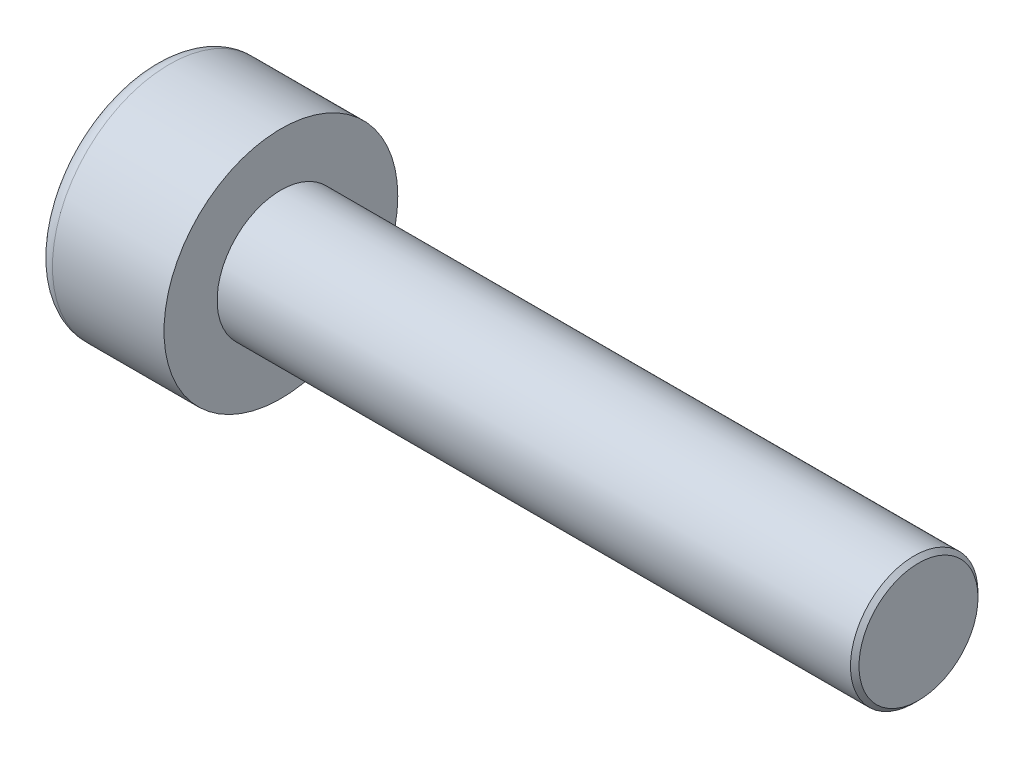
ISO-10303-21;
HEADER;
FILE_DESCRIPTION(('STEP AP214'),'2;1');
FILE_NAME('part.step','',(''),(''),'','','');
FILE_SCHEMA(('AUTOMOTIVE_DESIGN { 1 0 10303 214 1 1 1 1 }'));
ENDSEC;
DATA;
#1=APPLICATION_CONTEXT('core data for automotive mechanical design processes');
#2=APPLICATION_PROTOCOL_DEFINITION('international standard','automotive_design',2000,#1);
#3=PRODUCT_CONTEXT('',#1,'mechanical');
#4=PRODUCT('Part','Part','',(#3));
#5=PRODUCT_RELATED_PRODUCT_CATEGORY('part','',(#4));
#6=PRODUCT_DEFINITION_FORMATION('','',#4);
#7=PRODUCT_DEFINITION_CONTEXT('part definition',#1,'design');
#8=PRODUCT_DEFINITION('design','',#6,#7);
#9=PRODUCT_DEFINITION_SHAPE('','',#8);
#10=(LENGTH_UNIT() NAMED_UNIT(*) SI_UNIT(.MILLI.,.METRE.));
#11=(NAMED_UNIT(*) PLANE_ANGLE_UNIT() SI_UNIT($,.RADIAN.));
#12=(NAMED_UNIT(*) SI_UNIT($,.STERADIAN.) SOLID_ANGLE_UNIT());
#13=UNCERTAINTY_MEASURE_WITH_UNIT(LENGTH_MEASURE(1.E-05),#10,'distance_accuracy_value','');
#14=(GEOMETRIC_REPRESENTATION_CONTEXT(3) GLOBAL_UNCERTAINTY_ASSIGNED_CONTEXT((#13)) GLOBAL_UNIT_ASSIGNED_CONTEXT((#10,
#11,#12)) REPRESENTATION_CONTEXT('',''));
#15=CARTESIAN_POINT('',(0.,0.,0.));
#16=DIRECTION('',(0.,0.,1.));
#17=DIRECTION('',(1.,0.,0.));
#18=AXIS2_PLACEMENT_3D('',#15,#16,#17);
#19=CARTESIAN_POINT('',(1.3,-2.5,0.));
#20=DIRECTION('',(-1.,0.,0.));
#21=DIRECTION('',(0.,0.,1.));
#22=AXIS2_PLACEMENT_3D('',#19,#20,#21);
#23=PLANE('',#22);
#24=DIRECTION('',(0.,-0.866025403784438,-0.5));
#25=VECTOR('',#24,1.);
#26=CARTESIAN_POINT('',(1.3,0.,1.44337567297406));
#27=LINE('',#26,#25);
#28=CARTESIAN_POINT('',(1.3,-0.625,1.08253175473055));
#29=VERTEX_POINT('',#28);
#30=CARTESIAN_POINT('',(1.3,-1.25,0.721687836487031));
#31=VERTEX_POINT('',#30);
#32=EDGE_CURVE('E165',#29,#31,#27,.T.);
#33=ORIENTED_EDGE('',*,*,#32,.F.);
#34=CARTESIAN_POINT('',(1.3,0.,0.));
#35=DIRECTION('',(-1.,0.,0.));
#36=DIRECTION('',(0.,0.,1.));
#37=AXIS2_PLACEMENT_3D('',#34,#35,#36);
#38=CIRCLE('',#37,1.25);
#39=CARTESIAN_POINT('',(1.3,-1.25,0.));
#40=VERTEX_POINT('',#39);
#41=EDGE_CURVE('E60',#29,#40,#38,.F.);
#42=ORIENTED_EDGE('',*,*,#41,.T.);
#43=DIRECTION('',(0.,0.,-1.));
#44=VECTOR('',#43,1.);
#45=CARTESIAN_POINT('',(1.3,-1.25,0.721687836487031));
#46=LINE('',#45,#44);
#47=EDGE_CURVE('E170',#31,#40,#46,.T.);
#48=ORIENTED_EDGE('',*,*,#47,.F.);
#49=EDGE_LOOP('',(#33,#42,#48));
#50=FACE_BOUND('',#49,.T.);
#51=ADVANCED_FACE('F45',(#50),#23,.T.);
#52=CARTESIAN_POINT('',(1.3,-1.25,-0.721687836487036));
#53=VERTEX_POINT('',#52);
#54=EDGE_CURVE('E169',#40,#53,#46,.T.);
#55=ORIENTED_EDGE('',*,*,#54,.F.);
#56=CARTESIAN_POINT('',(1.3,-0.625,-1.08253175473055));
#57=VERTEX_POINT('',#56);
#58=EDGE_CURVE('E145',#40,#57,#38,.F.);
#59=ORIENTED_EDGE('',*,*,#58,.T.);
#60=DIRECTION('',(0.,0.866025403784439,-0.5));
#61=VECTOR('',#60,1.);
#62=CARTESIAN_POINT('',(1.3,-1.25,-0.721687836487036));
#63=LINE('',#62,#61);
#64=EDGE_CURVE('E153',#53,#57,#63,.T.);
#65=ORIENTED_EDGE('',*,*,#64,.F.);
#66=EDGE_LOOP('',(#55,#59,#65));
#67=FACE_BOUND('',#66,.T.);
#68=ADVANCED_FACE('F226',(#67),#23,.T.);
#69=CARTESIAN_POINT('',(1.3,0.,-1.44337567297407));
#70=VERTEX_POINT('',#69);
#71=EDGE_CURVE('E143',#57,#70,#63,.T.);
#72=ORIENTED_EDGE('',*,*,#71,.F.);
#73=CARTESIAN_POINT('',(1.3,0.624999999999999,-1.08253175473055));
#74=VERTEX_POINT('',#73);
#75=EDGE_CURVE('E127',#57,#74,#38,.F.);
#76=ORIENTED_EDGE('',*,*,#75,.T.);
#77=DIRECTION('',(0.,0.866025403784439,0.5));
#78=VECTOR('',#77,1.);
#79=CARTESIAN_POINT('',(1.3,0.,-1.44337567297407));
#80=LINE('',#79,#78);
#81=EDGE_CURVE('E141',#70,#74,#80,.T.);
#82=ORIENTED_EDGE('',*,*,#81,.F.);
#83=EDGE_LOOP('',(#72,#76,#82));
#84=FACE_BOUND('',#83,.T.);
#85=ADVANCED_FACE('F139',(#84),#23,.T.);
#86=CARTESIAN_POINT('',(1.3,1.25,-0.721687836487031));
#87=VERTEX_POINT('',#86);
#88=EDGE_CURVE('E147',#74,#87,#80,.T.);
#89=ORIENTED_EDGE('',*,*,#88,.F.);
#90=CARTESIAN_POINT('',(1.3,0.,0.));
#91=DIRECTION('',(1.,0.,0.));
#92=DIRECTION('',(0.,0.,-1.));
#93=AXIS2_PLACEMENT_3D('',#90,#91,#92);
#94=CIRCLE('',#93,1.25);
#95=CARTESIAN_POINT('',(1.3,1.25,0.));
#96=VERTEX_POINT('',#95);
#97=EDGE_CURVE('E125',#74,#96,#94,.T.);
#98=ORIENTED_EDGE('',*,*,#97,.T.);
#99=DIRECTION('',(0.,0.,1.));
#100=VECTOR('',#99,1.);
#101=CARTESIAN_POINT('',(1.3,1.25,-0.721687836487031));
#102=LINE('',#101,#100);
#103=EDGE_CURVE('E150',#87,#96,#102,.T.);
#104=ORIENTED_EDGE('',*,*,#103,.F.);
#105=EDGE_LOOP('',(#89,#98,#104));
#106=FACE_BOUND('',#105,.T.);
#107=ADVANCED_FACE('F148',(#106),#23,.T.);
#108=CARTESIAN_POINT('',(1.3,1.25,0.721687836487031));
#109=VERTEX_POINT('',#108);
#110=EDGE_CURVE('E157',#96,#109,#102,.T.);
#111=ORIENTED_EDGE('',*,*,#110,.F.);
#112=CARTESIAN_POINT('',(1.3,0.625,1.08253175473055));
#113=VERTEX_POINT('',#112);
#114=EDGE_CURVE('E130',#96,#113,#38,.F.);
#115=ORIENTED_EDGE('',*,*,#114,.T.);
#116=DIRECTION('',(0.,-0.866025403784438,0.5));
#117=VECTOR('',#116,1.);
#118=CARTESIAN_POINT('',(1.3,1.25,0.721687836487031));
#119=LINE('',#118,#117);
#120=EDGE_CURVE('E162',#109,#113,#119,.T.);
#121=ORIENTED_EDGE('',*,*,#120,.F.);
#122=EDGE_LOOP('',(#111,#115,#121));
#123=FACE_BOUND('',#122,.T.);
#124=ADVANCED_FACE('F238',(#123),#23,.T.);
#125=CARTESIAN_POINT('',(1.3,0.,1.44337567297406));
#126=VERTEX_POINT('',#125);
#127=EDGE_CURVE('E161',#113,#126,#119,.T.);
#128=ORIENTED_EDGE('',*,*,#127,.F.);
#129=EDGE_CURVE('E206',#113,#29,#38,.F.);
#130=ORIENTED_EDGE('',*,*,#129,.T.);
#131=EDGE_CURVE('E166',#126,#29,#27,.T.);
#132=ORIENTED_EDGE('',*,*,#131,.F.);
#133=EDGE_LOOP('',(#128,#130,#132));
#134=FACE_BOUND('',#133,.T.);
#135=ADVANCED_FACE('F229',(#134),#23,.T.);
#136=CARTESIAN_POINT('',(0.,0.,0.));
#137=DIRECTION('',(1.,0.,0.));
#138=DIRECTION('',(0.,0.,-1.));
#139=AXIS2_PLACEMENT_3D('',#136,#137,#138);
#140=PLANE('',#139);
#141=CARTESIAN_POINT('',(0.,0.,0.));
#142=DIRECTION('',(1.,0.,0.));
#143=DIRECTION('',(0.,0.,-1.));
#144=AXIS2_PLACEMENT_3D('',#141,#142,#143);
#145=CIRCLE('',#144,2.375);
#146=CARTESIAN_POINT('',(0.,0.,-2.375));
#147=VERTEX_POINT('',#146);
#148=EDGE_CURVE('E211',#147,#147,#145,.F.);
#149=ORIENTED_EDGE('',*,*,#148,.T.);
#150=EDGE_LOOP('',(#149));
#151=FACE_BOUND('',#150,.T.);
#152=DIRECTION('',(0.,0.866025403784439,-0.5));
#153=VECTOR('',#152,1.);
#154=CARTESIAN_POINT('',(0.,-1.25,-0.721687836487036));
#155=LINE('',#154,#153);
#156=CARTESIAN_POINT('',(0.,-1.25,-0.721687836487036));
#157=VERTEX_POINT('',#156);
#158=CARTESIAN_POINT('',(0.,0.,-1.44337567297407));
#159=VERTEX_POINT('',#158);
#160=EDGE_CURVE('E68',#157,#159,#155,.T.);
#161=ORIENTED_EDGE('',*,*,#160,.T.);
#162=DIRECTION('',(0.,0.866025403784439,0.5));
#163=VECTOR('',#162,1.);
#164=CARTESIAN_POINT('',(0.,0.,-1.44337567297407));
#165=LINE('',#164,#163);
#166=CARTESIAN_POINT('',(0.,1.25,-0.721687836487031));
#167=VERTEX_POINT('',#166);
#168=EDGE_CURVE('E175',#159,#167,#165,.T.);
#169=ORIENTED_EDGE('',*,*,#168,.T.);
#170=DIRECTION('',(0.,0.,1.));
#171=VECTOR('',#170,1.);
#172=CARTESIAN_POINT('',(0.,1.25,-0.721687836487031));
#173=LINE('',#172,#171);
#174=CARTESIAN_POINT('',(0.,1.25,0.721687836487031));
#175=VERTEX_POINT('',#174);
#176=EDGE_CURVE('E178',#167,#175,#173,.T.);
#177=ORIENTED_EDGE('',*,*,#176,.T.);
#178=DIRECTION('',(0.,-0.866025403784438,0.5));
#179=VECTOR('',#178,1.);
#180=CARTESIAN_POINT('',(0.,1.25,0.721687836487031));
#181=LINE('',#180,#179);
#182=CARTESIAN_POINT('',(0.,0.,1.44337567297406));
#183=VERTEX_POINT('',#182);
#184=EDGE_CURVE('E181',#175,#183,#181,.T.);
#185=ORIENTED_EDGE('',*,*,#184,.T.);
#186=DIRECTION('',(0.,-0.866025403784438,-0.5));
#187=VECTOR('',#186,1.);
#188=CARTESIAN_POINT('',(0.,0.,1.44337567297406));
#189=LINE('',#188,#187);
#190=CARTESIAN_POINT('',(0.,-1.25,0.721687836487031));
#191=VERTEX_POINT('',#190);
#192=EDGE_CURVE('E184',#183,#191,#189,.T.);
#193=ORIENTED_EDGE('',*,*,#192,.T.);
#194=DIRECTION('',(0.,0.,-1.));
#195=VECTOR('',#194,1.);
#196=CARTESIAN_POINT('',(0.,-1.25,0.721687836487031));
#197=LINE('',#196,#195);
#198=EDGE_CURVE('E187',#191,#157,#197,.T.);
#199=ORIENTED_EDGE('',*,*,#198,.T.);
#200=EDGE_LOOP('',(#161,#169,#177,#185,#193,#199));
#201=FACE_BOUND('',#200,.T.);
#202=ADVANCED_FACE('F237',(#151,#201),#140,.F.);
#203=CARTESIAN_POINT('',(3.,0.,0.));
#204=DIRECTION('',(1.,0.,0.));
#205=DIRECTION('',(0.,0.,-1.));
#206=AXIS2_PLACEMENT_3D('',#203,#204,#205);
#207=PLANE('',#206);
#208=CARTESIAN_POINT('',(3.,0.,0.));
#209=DIRECTION('',(1.,0.,0.));
#210=DIRECTION('',(0.,0.,-1.));
#211=AXIS2_PLACEMENT_3D('',#208,#209,#210);
#212=CIRCLE('',#211,2.75);
#213=CARTESIAN_POINT('',(3.,0.,-2.75));
#214=VERTEX_POINT('',#213);
#215=EDGE_CURVE('E203',#214,#214,#212,.T.);
#216=ORIENTED_EDGE('',*,*,#215,.T.);
#217=EDGE_LOOP('',(#216));
#218=FACE_BOUND('',#217,.T.);
#219=CARTESIAN_POINT('',(3.,0.,0.));
#220=DIRECTION('',(1.,0.,0.));
#221=DIRECTION('',(0.,0.,-1.));
#222=AXIS2_PLACEMENT_3D('',#219,#220,#221);
#223=CIRCLE('',#222,1.5);
#224=CARTESIAN_POINT('',(3.,0.,-1.5));
#225=VERTEX_POINT('',#224);
#226=EDGE_CURVE('E200',#225,#225,#223,.T.);
#227=ORIENTED_EDGE('',*,*,#226,.F.);
#228=EDGE_LOOP('',(#227));
#229=FACE_BOUND('',#228,.T.);
#230=ADVANCED_FACE('F244',(#218,#229),#207,.T.);
#231=CARTESIAN_POINT('',(3.,0.,0.));
#232=DIRECTION('',(-1.,0.,0.));
#233=DIRECTION('',(0.,0.,1.));
#234=AXIS2_PLACEMENT_3D('',#231,#232,#233);
#235=CYLINDRICAL_SURFACE('',#234,2.75);
#236=CARTESIAN_POINT('',(0.375,0.,0.));
#237=DIRECTION('',(1.,0.,0.));
#238=DIRECTION('',(0.,0.,-1.));
#239=AXIS2_PLACEMENT_3D('',#236,#237,#238);
#240=CIRCLE('',#239,2.75);
#241=CARTESIAN_POINT('',(0.375,0.,-2.75));
#242=VERTEX_POINT('',#241);
#243=EDGE_CURVE('E208',#242,#242,#240,.T.);
#244=ORIENTED_EDGE('',*,*,#243,.T.);
#245=EDGE_LOOP('',(#244));
#246=FACE_BOUND('',#245,.T.);
#247=ORIENTED_EDGE('',*,*,#215,.F.);
#248=EDGE_LOOP('',(#247));
#249=FACE_BOUND('',#248,.T.);
#250=ADVANCED_FACE('F289',(#246,#249),#235,.T.);
#251=CARTESIAN_POINT('',(18.,0.,0.));
#252=DIRECTION('',(-1.,0.,0.));
#253=DIRECTION('',(0.,0.,1.));
#254=AXIS2_PLACEMENT_3D('',#251,#252,#253);
#255=CYLINDRICAL_SURFACE('',#254,1.5);
#256=CARTESIAN_POINT('',(17.9,0.,0.));
#257=DIRECTION('',(1.,0.,0.));
#258=DIRECTION('',(0.,0.,-1.));
#259=AXIS2_PLACEMENT_3D('',#256,#257,#258);
#260=CIRCLE('',#259,1.5);
#261=CARTESIAN_POINT('',(17.9,0.,-1.5));
#262=VERTEX_POINT('',#261);
#263=EDGE_CURVE('E11',#262,#262,#260,.F.);
#264=ORIENTED_EDGE('',*,*,#263,.T.);
#265=EDGE_LOOP('',(#264));
#266=FACE_BOUND('',#265,.T.);
#267=ORIENTED_EDGE('',*,*,#226,.T.);
#268=EDGE_LOOP('',(#267));
#269=FACE_BOUND('',#268,.T.);
#270=ADVANCED_FACE('F286',(#266,#269),#255,.T.);
#271=CARTESIAN_POINT('',(18.,0.,0.));
#272=DIRECTION('',(1.,0.,0.));
#273=DIRECTION('',(0.,0.,-1.));
#274=AXIS2_PLACEMENT_3D('',#271,#272,#273);
#275=PLANE('',#274);
#276=CARTESIAN_POINT('',(18.,0.,0.));
#277=DIRECTION('',(1.,0.,0.));
#278=DIRECTION('',(0.,0.,-1.));
#279=AXIS2_PLACEMENT_3D('',#276,#277,#278);
#280=CIRCLE('',#279,1.4);
#281=CARTESIAN_POINT('',(18.,0.,-1.4));
#282=VERTEX_POINT('',#281);
#283=EDGE_CURVE('E53',#282,#282,#280,.T.);
#284=ORIENTED_EDGE('',*,*,#283,.T.);
#285=EDGE_LOOP('',(#284));
#286=FACE_BOUND('',#285,.T.);
#287=ADVANCED_FACE('F216',(#286),#275,.T.);
#288=CARTESIAN_POINT('',(1.3,-1.25,-0.721687836487036));
#289=DIRECTION('',(0.,0.5,0.866025403784439));
#290=DIRECTION('',(0.,-0.866025403784439,0.5));
#291=AXIS2_PLACEMENT_3D('',#288,#289,#290);
#292=PLANE('',#291);
#293=ORIENTED_EDGE('',*,*,#160,.F.);
#294=DIRECTION('',(-1.,0.,0.));
#295=VECTOR('',#294,1.);
#296=CARTESIAN_POINT('',(1.3,-1.25,-0.721687836487036));
#297=LINE('',#296,#295);
#298=EDGE_CURVE('E173',#53,#157,#297,.T.);
#299=ORIENTED_EDGE('',*,*,#298,.F.);
#300=ORIENTED_EDGE('',*,*,#64,.T.);
#301=ORIENTED_EDGE('',*,*,#71,.T.);
#302=DIRECTION('',(-1.,0.,0.));
#303=VECTOR('',#302,1.);
#304=CARTESIAN_POINT('',(1.3,0.,-1.44337567297407));
#305=LINE('',#304,#303);
#306=EDGE_CURVE('E156',#70,#159,#305,.T.);
#307=ORIENTED_EDGE('',*,*,#306,.T.);
#308=EDGE_LOOP('',(#293,#299,#300,#301,#307));
#309=FACE_BOUND('',#308,.T.);
#310=ADVANCED_FACE('F260',(#309),#292,.T.);
#311=CARTESIAN_POINT('',(1.3,0.,-1.44337567297407));
#312=DIRECTION('',(0.,-0.5,0.866025403784439));
#313=DIRECTION('',(0.,-0.866025403784439,-0.5));
#314=AXIS2_PLACEMENT_3D('',#311,#312,#313);
#315=PLANE('',#314);
#316=ORIENTED_EDGE('',*,*,#168,.F.);
#317=ORIENTED_EDGE('',*,*,#306,.F.);
#318=ORIENTED_EDGE('',*,*,#81,.T.);
#319=ORIENTED_EDGE('',*,*,#88,.T.);
#320=DIRECTION('',(-1.,0.,0.));
#321=VECTOR('',#320,1.);
#322=CARTESIAN_POINT('',(1.3,1.25,-0.721687836487031));
#323=LINE('',#322,#321);
#324=EDGE_CURVE('E197',#87,#167,#323,.T.);
#325=ORIENTED_EDGE('',*,*,#324,.T.);
#326=EDGE_LOOP('',(#316,#317,#318,#319,#325));
#327=FACE_BOUND('',#326,.T.);
#328=ADVANCED_FACE('F155',(#327),#315,.T.);
#329=CARTESIAN_POINT('',(1.3,1.25,-0.721687836487031));
#330=DIRECTION('',(0.,-1.,0.));
#331=DIRECTION('',(0.,0.,-1.));
#332=AXIS2_PLACEMENT_3D('',#329,#330,#331);
#333=PLANE('',#332);
#334=ORIENTED_EDGE('',*,*,#176,.F.);
#335=ORIENTED_EDGE('',*,*,#324,.F.);
#336=ORIENTED_EDGE('',*,*,#103,.T.);
#337=ORIENTED_EDGE('',*,*,#110,.T.);
#338=DIRECTION('',(-1.,0.,0.));
#339=VECTOR('',#338,1.);
#340=CARTESIAN_POINT('',(1.3,1.25,0.721687836487031));
#341=LINE('',#340,#339);
#342=EDGE_CURVE('E195',#109,#175,#341,.T.);
#343=ORIENTED_EDGE('',*,*,#342,.T.);
#344=EDGE_LOOP('',(#334,#335,#336,#337,#343));
#345=FACE_BOUND('',#344,.T.);
#346=ADVANCED_FACE('F258',(#345),#333,.T.);
#347=CARTESIAN_POINT('',(1.3,1.25,0.721687836487031));
#348=DIRECTION('',(0.,-0.5,-0.866025403784438));
#349=DIRECTION('',(0.,0.866025403784439,-0.5));
#350=AXIS2_PLACEMENT_3D('',#347,#348,#349);
#351=PLANE('',#350);
#352=ORIENTED_EDGE('',*,*,#184,.F.);
#353=ORIENTED_EDGE('',*,*,#342,.F.);
#354=ORIENTED_EDGE('',*,*,#120,.T.);
#355=ORIENTED_EDGE('',*,*,#127,.T.);
#356=DIRECTION('',(-1.,0.,0.));
#357=VECTOR('',#356,1.);
#358=CARTESIAN_POINT('',(1.3,0.,1.44337567297406));
#359=LINE('',#358,#357);
#360=EDGE_CURVE('E193',#126,#183,#359,.T.);
#361=ORIENTED_EDGE('',*,*,#360,.T.);
#362=EDGE_LOOP('',(#352,#353,#354,#355,#361));
#363=FACE_BOUND('',#362,.T.);
#364=ADVANCED_FACE('F255',(#363),#351,.T.);
#365=CARTESIAN_POINT('',(1.3,0.,1.44337567297406));
#366=DIRECTION('',(0.,0.5,-0.866025403784438));
#367=DIRECTION('',(0.,0.866025403784438,0.5));
#368=AXIS2_PLACEMENT_3D('',#365,#366,#367);
#369=PLANE('',#368);
#370=ORIENTED_EDGE('',*,*,#192,.F.);
#371=ORIENTED_EDGE('',*,*,#360,.F.);
#372=ORIENTED_EDGE('',*,*,#131,.T.);
#373=ORIENTED_EDGE('',*,*,#32,.T.);
#374=DIRECTION('',(-1.,0.,0.));
#375=VECTOR('',#374,1.);
#376=CARTESIAN_POINT('',(1.3,-1.25,0.721687836487031));
#377=LINE('',#376,#375);
#378=EDGE_CURVE('E191',#31,#191,#377,.T.);
#379=ORIENTED_EDGE('',*,*,#378,.T.);
#380=EDGE_LOOP('',(#370,#371,#372,#373,#379));
#381=FACE_BOUND('',#380,.T.);
#382=ADVANCED_FACE('F269',(#381),#369,.T.);
#383=CARTESIAN_POINT('',(1.3,-1.25,0.721687836487031));
#384=DIRECTION('',(0.,1.,0.));
#385=DIRECTION('',(0.,0.,1.));
#386=AXIS2_PLACEMENT_3D('',#383,#384,#385);
#387=PLANE('',#386);
#388=ORIENTED_EDGE('',*,*,#198,.F.);
#389=ORIENTED_EDGE('',*,*,#378,.F.);
#390=ORIENTED_EDGE('',*,*,#47,.T.);
#391=ORIENTED_EDGE('',*,*,#54,.T.);
#392=ORIENTED_EDGE('',*,*,#298,.T.);
#393=EDGE_LOOP('',(#388,#389,#390,#391,#392));
#394=FACE_BOUND('',#393,.T.);
#395=ADVANCED_FACE('F122',(#394),#387,.T.);
#396=CARTESIAN_POINT('',(1.3,0.,0.));
#397=DIRECTION('',(-1.,0.,0.));
#398=DIRECTION('',(0.,0.,1.));
#399=AXIS2_PLACEMENT_3D('',#396,#397,#398);
#400=CONICAL_SURFACE('',#399,1.25,1.04719755119659);
#401=CARTESIAN_POINT('',(2.02168783648704,0.,0.));
#402=VERTEX_POINT('',#401);
#403=VERTEX_LOOP('',#402);
#404=FACE_BOUND('',#403,.T.);
#405=ORIENTED_EDGE('',*,*,#97,.F.);
#406=ORIENTED_EDGE('',*,*,#75,.F.);
#407=ORIENTED_EDGE('',*,*,#58,.F.);
#408=ORIENTED_EDGE('',*,*,#41,.F.);
#409=ORIENTED_EDGE('',*,*,#129,.F.);
#410=ORIENTED_EDGE('',*,*,#114,.F.);
#411=EDGE_LOOP('',(#405,#406,#407,#408,#409,#410));
#412=FACE_BOUND('',#411,.T.);
#413=ADVANCED_FACE('F119',(#404,#412),#400,.F.);
#414=CARTESIAN_POINT('',(0.375,0.,0.));
#415=DIRECTION('',(1.,0.,0.));
#416=DIRECTION('',(0.,0.,-1.));
#417=AXIS2_PLACEMENT_3D('',#414,#415,#416);
#418=TOROIDAL_SURFACE('',#417,2.375,0.375);
#419=ORIENTED_EDGE('',*,*,#148,.F.);
#420=EDGE_LOOP('',(#419));
#421=FACE_BOUND('',#420,.T.);
#422=ORIENTED_EDGE('',*,*,#243,.F.);
#423=EDGE_LOOP('',(#422));
#424=FACE_BOUND('',#423,.T.);
#425=ADVANCED_FACE('F121',(#421,#424),#418,.T.);
#426=CARTESIAN_POINT('',(18.,0.,0.));
#427=DIRECTION('',(-1.,0.,0.));
#428=DIRECTION('',(0.,0.,1.));
#429=AXIS2_PLACEMENT_3D('',#426,#427,#428);
#430=CONICAL_SURFACE('',#429,1.4,0.785398163397445);
#431=ORIENTED_EDGE('',*,*,#263,.F.);
#432=EDGE_LOOP('',(#431));
#433=FACE_BOUND('',#432,.T.);
#434=ORIENTED_EDGE('',*,*,#283,.F.);
#435=EDGE_LOOP('',(#434));
#436=FACE_BOUND('',#435,.T.);
#437=ADVANCED_FACE('F47',(#433,#436),#430,.T.);
#438=CLOSED_SHELL('',(#51,#68,#85,#107,#124,#135,#202,#230,#250,#270,#287,#310,#328,#346,#364,
#382,#395,#413,#425,#437));
#439=MANIFOLD_SOLID_BREP('B2',#438);
#440=ADVANCED_BREP_SHAPE_REPRESENTATION('',(#18,#439),#14);
#441=SHAPE_DEFINITION_REPRESENTATION(#9,#440);
ENDSEC;
END-ISO-10303-21;
